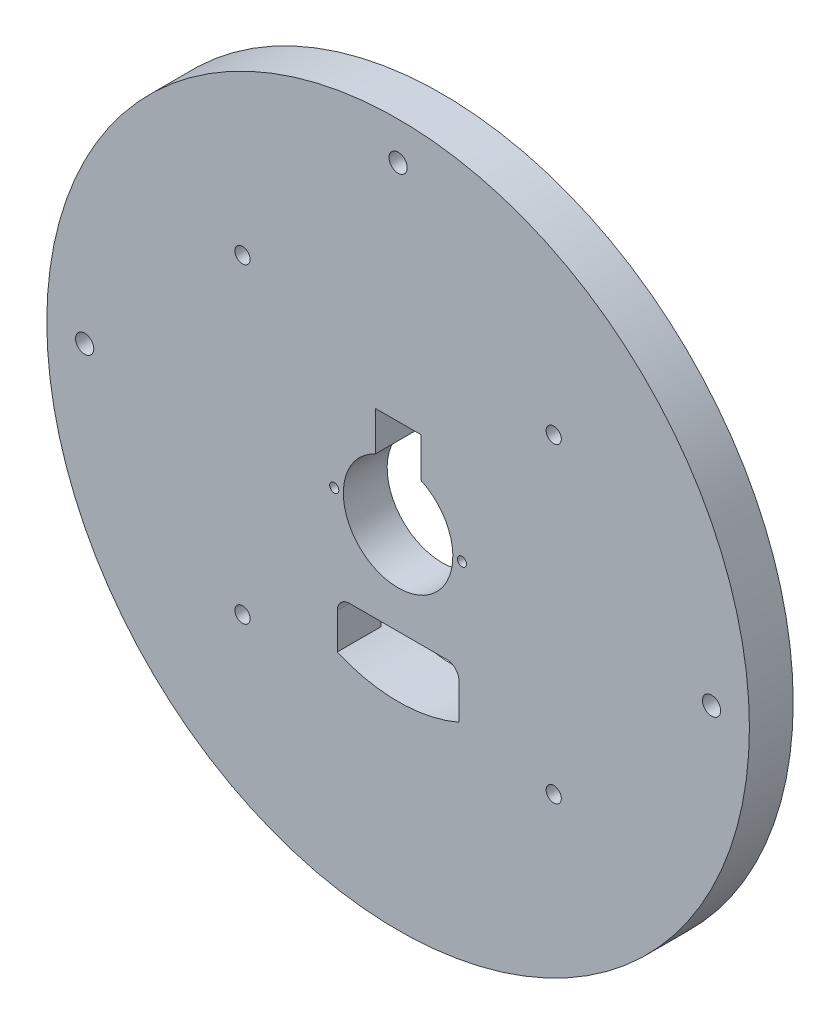
ISO-10303-21;
HEADER;
FILE_DESCRIPTION(('STEP AP214'),'2;1');
FILE_NAME('part.step','',(''),(''),'','','');
FILE_SCHEMA(('AUTOMOTIVE_DESIGN { 1 0 10303 214 1 1 1 1 }'));
ENDSEC;
DATA;
#1=APPLICATION_CONTEXT('core data for automotive mechanical design processes');
#2=APPLICATION_PROTOCOL_DEFINITION('international standard','automotive_design',2000,#1);
#3=PRODUCT_CONTEXT('',#1,'mechanical');
#4=PRODUCT('Part','Part','',(#3));
#5=PRODUCT_RELATED_PRODUCT_CATEGORY('part','',(#4));
#6=PRODUCT_DEFINITION_FORMATION('','',#4);
#7=PRODUCT_DEFINITION_CONTEXT('part definition',#1,'design');
#8=PRODUCT_DEFINITION('design','',#6,#7);
#9=PRODUCT_DEFINITION_SHAPE('','',#8);
#10=(LENGTH_UNIT() NAMED_UNIT(*) SI_UNIT(.MILLI.,.METRE.));
#11=(NAMED_UNIT(*) PLANE_ANGLE_UNIT() SI_UNIT($,.RADIAN.));
#12=(NAMED_UNIT(*) SI_UNIT($,.STERADIAN.) SOLID_ANGLE_UNIT());
#13=UNCERTAINTY_MEASURE_WITH_UNIT(LENGTH_MEASURE(1.E-05),#10,'distance_accuracy_value','');
#14=(GEOMETRIC_REPRESENTATION_CONTEXT(3) GLOBAL_UNCERTAINTY_ASSIGNED_CONTEXT((#13)) GLOBAL_UNIT_ASSIGNED_CONTEXT((#10,
#11,#12)) REPRESENTATION_CONTEXT('',''));
#15=CARTESIAN_POINT('',(0.,0.,0.));
#16=DIRECTION('',(0.,0.,1.));
#17=DIRECTION('',(1.,0.,0.));
#18=AXIS2_PLACEMENT_3D('',#15,#16,#17);
#19=CARTESIAN_POINT('',(0.,0.,0.));
#20=DIRECTION('',(0.,0.,1.));
#21=DIRECTION('',(1.,0.,0.));
#22=AXIS2_PLACEMENT_3D('',#19,#20,#21);
#23=PLANE('',#22);
#24=CARTESIAN_POINT('',(21.,0.,0.));
#25=DIRECTION('',(0.,0.,-1.));
#26=DIRECTION('',(-1.,0.,0.));
#27=AXIS2_PLACEMENT_3D('',#24,#25,#26);
#28=CIRCLE('',#27,1.49999999999999);
#29=CARTESIAN_POINT('',(19.5,0.,0.));
#30=VERTEX_POINT('',#29);
#31=EDGE_CURVE('E358',#30,#30,#28,.T.);
#32=ORIENTED_EDGE('',*,*,#31,.F.);
#33=EDGE_LOOP('',(#32));
#34=FACE_BOUND('',#33,.T.);
#35=CARTESIAN_POINT('',(-21.,0.,0.));
#36=DIRECTION('',(0.,0.,-1.));
#37=DIRECTION('',(-1.,0.,0.));
#38=AXIS2_PLACEMENT_3D('',#35,#36,#37);
#39=CIRCLE('',#38,1.49999999999999);
#40=CARTESIAN_POINT('',(-22.5,0.,0.));
#41=VERTEX_POINT('',#40);
#42=EDGE_CURVE('E364',#41,#41,#39,.T.);
#43=ORIENTED_EDGE('',*,*,#42,.F.);
#44=EDGE_LOOP('',(#43));
#45=FACE_BOUND('',#44,.T.);
#46=CARTESIAN_POINT('',(0.,0.,0.));
#47=DIRECTION('',(0.,0.,-1.));
#48=DIRECTION('',(-1.,0.,0.));
#49=AXIS2_PLACEMENT_3D('',#46,#47,#48);
#50=CIRCLE('',#49,18.);
#51=CARTESIAN_POINT('',(7.5,16.3630681719536,0.));
#52=VERTEX_POINT('',#51);
#53=CARTESIAN_POINT('',(-7.5,16.3630681719536,0.));
#54=VERTEX_POINT('',#53);
#55=EDGE_CURVE('E212',#52,#54,#50,.T.);
#56=ORIENTED_EDGE('',*,*,#55,.F.);
#57=DIRECTION('',(0.,-1.,0.));
#58=VECTOR('',#57,1.);
#59=CARTESIAN_POINT('',(7.5,16.3630681719536,0.));
#60=LINE('',#59,#58);
#61=CARTESIAN_POINT('',(7.5,29.3630681719536,0.));
#62=VERTEX_POINT('',#61);
#63=EDGE_CURVE('E227',#62,#52,#60,.T.);
#64=ORIENTED_EDGE('',*,*,#63,.F.);
#65=DIRECTION('',(1.,0.,0.));
#66=VECTOR('',#65,1.);
#67=CARTESIAN_POINT('',(7.5,29.3630681719536,0.));
#68=LINE('',#67,#66);
#69=CARTESIAN_POINT('',(-7.5,29.3630681719536,0.));
#70=VERTEX_POINT('',#69);
#71=EDGE_CURVE('E225',#70,#62,#68,.T.);
#72=ORIENTED_EDGE('',*,*,#71,.F.);
#73=DIRECTION('',(0.,1.,0.));
#74=VECTOR('',#73,1.);
#75=CARTESIAN_POINT('',(-7.5,29.3630681719536,0.));
#76=LINE('',#75,#74);
#77=EDGE_CURVE('E222',#54,#70,#76,.T.);
#78=ORIENTED_EDGE('',*,*,#77,.F.);
#79=EDGE_LOOP('',(#56,#64,#72,#78));
#80=FACE_BOUND('',#79,.T.);
#81=DIRECTION('',(0.,1.,0.));
#82=VECTOR('',#81,1.);
#83=CARTESIAN_POINT('',(20.,-46.2618633433631,0.));
#84=LINE('',#83,#82);
#85=CARTESIAN_POINT('',(20.,-46.2618633433631,0.));
#86=VERTEX_POINT('',#85);
#87=CARTESIAN_POINT('',(20.,-34.4,0.));
#88=VERTEX_POINT('',#87);
#89=EDGE_CURVE('E64',#86,#88,#84,.T.);
#90=ORIENTED_EDGE('',*,*,#89,.T.);
#91=CARTESIAN_POINT('',(16.,-34.4,0.));
#92=DIRECTION('',(0.,0.,1.));
#93=DIRECTION('',(1.,0.,0.));
#94=AXIS2_PLACEMENT_3D('',#91,#92,#93);
#95=CIRCLE('',#94,4.);
#96=CARTESIAN_POINT('',(16.,-30.4,0.));
#97=VERTEX_POINT('',#96);
#98=EDGE_CURVE('E187',#88,#97,#95,.T.);
#99=ORIENTED_EDGE('',*,*,#98,.T.);
#100=DIRECTION('',(-1.,0.,0.));
#101=VECTOR('',#100,1.);
#102=CARTESIAN_POINT('',(16.,-30.4,0.));
#103=LINE('',#102,#101);
#104=CARTESIAN_POINT('',(-16.,-30.4,0.));
#105=VERTEX_POINT('',#104);
#106=EDGE_CURVE('E205',#97,#105,#103,.T.);
#107=ORIENTED_EDGE('',*,*,#106,.T.);
#108=CARTESIAN_POINT('',(-16.,-34.4,0.));
#109=DIRECTION('',(0.,0.,1.));
#110=DIRECTION('',(1.,0.,0.));
#111=AXIS2_PLACEMENT_3D('',#108,#109,#110);
#112=CIRCLE('',#111,4.);
#113=CARTESIAN_POINT('',(-20.,-34.4,0.));
#114=VERTEX_POINT('',#113);
#115=EDGE_CURVE('E201',#105,#114,#112,.T.);
#116=ORIENTED_EDGE('',*,*,#115,.T.);
#117=DIRECTION('',(0.,-1.,0.));
#118=VECTOR('',#117,1.);
#119=CARTESIAN_POINT('',(-20.,-34.4,0.));
#120=LINE('',#119,#118);
#121=CARTESIAN_POINT('',(-20.,-46.2618633433631,0.));
#122=VERTEX_POINT('',#121);
#123=EDGE_CURVE('E199',#114,#122,#120,.T.);
#124=ORIENTED_EDGE('',*,*,#123,.T.);
#125=CARTESIAN_POINT('',(0.,0.,0.));
#126=DIRECTION('',(0.,0.,-1.));
#127=DIRECTION('',(-1.,0.,0.));
#128=AXIS2_PLACEMENT_3D('',#125,#126,#127);
#129=CIRCLE('',#128,50.4);
#130=EDGE_CURVE('E180',#122,#86,#129,.T.);
#131=ORIENTED_EDGE('',*,*,#130,.T.);
#132=EDGE_LOOP('',(#90,#99,#107,#116,#124,#131));
#133=FACE_BOUND('',#132,.T.);
#134=ADVANCED_FACE('F39',(#34,#45,#80,#133),#23,.F.);
#135=CARTESIAN_POINT('',(0.,0.,14.4));
#136=DIRECTION('',(0.,0.,-1.));
#137=DIRECTION('',(-1.,0.,0.));
#138=AXIS2_PLACEMENT_3D('',#135,#136,#137);
#139=CYLINDRICAL_SURFACE('',#138,115.5);
#140=CARTESIAN_POINT('',(0.,0.,0.));
#141=DIRECTION('',(0.,0.,1.));
#142=DIRECTION('',(1.,0.,0.));
#143=AXIS2_PLACEMENT_3D('',#140,#141,#142);
#144=CIRCLE('',#143,115.5);
#145=CARTESIAN_POINT('',(115.5,0.,0.));
#146=VERTEX_POINT('',#145);
#147=EDGE_CURVE('E303',#146,#146,#144,.T.);
#148=ORIENTED_EDGE('',*,*,#147,.T.);
#149=EDGE_LOOP('',(#148));
#150=FACE_BOUND('',#149,.T.);
#151=CARTESIAN_POINT('',(0.,0.,14.4));
#152=DIRECTION('',(0.,0.,1.));
#153=DIRECTION('',(1.,0.,0.));
#154=AXIS2_PLACEMENT_3D('',#151,#152,#153);
#155=CIRCLE('',#154,115.5);
#156=CARTESIAN_POINT('',(115.5,0.,14.4));
#157=VERTEX_POINT('',#156);
#158=EDGE_CURVE('E311',#157,#157,#155,.T.);
#159=ORIENTED_EDGE('',*,*,#158,.F.);
#160=EDGE_LOOP('',(#159));
#161=FACE_BOUND('',#160,.T.);
#162=ADVANCED_FACE('F41',(#150,#161),#139,.T.);
#163=CARTESIAN_POINT('',(0.,0.,14.4));
#164=DIRECTION('',(0.,0.,1.));
#165=DIRECTION('',(1.,0.,0.));
#166=AXIS2_PLACEMENT_3D('',#163,#164,#165);
#167=PLANE('',#166);
#168=CARTESIAN_POINT('',(-103.05,0.,14.4));
#169=DIRECTION('',(0.,0.,1.));
#170=DIRECTION('',(1.,0.,0.));
#171=AXIS2_PLACEMENT_3D('',#168,#169,#170);
#172=CIRCLE('',#171,3.);
#173=CARTESIAN_POINT('',(-100.05,0.,14.4));
#174=VERTEX_POINT('',#173);
#175=EDGE_CURVE('E43',#174,#174,#172,.T.);
#176=ORIENTED_EDGE('',*,*,#175,.F.);
#177=EDGE_LOOP('',(#176));
#178=FACE_BOUND('',#177,.T.);
#179=CARTESIAN_POINT('',(103.05,0.,14.4));
#180=DIRECTION('',(0.,0.,1.));
#181=DIRECTION('',(1.,0.,0.));
#182=AXIS2_PLACEMENT_3D('',#179,#180,#181);
#183=CIRCLE('',#182,3.);
#184=CARTESIAN_POINT('',(106.05,0.,14.4));
#185=VERTEX_POINT('',#184);
#186=EDGE_CURVE('E343',#185,#185,#183,.T.);
#187=ORIENTED_EDGE('',*,*,#186,.F.);
#188=EDGE_LOOP('',(#187));
#189=FACE_BOUND('',#188,.T.);
#190=CARTESIAN_POINT('',(0.,103.05,14.4));
#191=DIRECTION('',(0.,0.,1.));
#192=DIRECTION('',(1.,0.,0.));
#193=AXIS2_PLACEMENT_3D('',#190,#191,#192);
#194=CIRCLE('',#193,2.99999999999999);
#195=CARTESIAN_POINT('',(2.99999999999999,103.05,14.4));
#196=VERTEX_POINT('',#195);
#197=EDGE_CURVE('E339',#196,#196,#194,.T.);
#198=ORIENTED_EDGE('',*,*,#197,.F.);
#199=EDGE_LOOP('',(#198));
#200=FACE_BOUND('',#199,.T.);
#201=CARTESIAN_POINT('',(21.,0.,14.4));
#202=DIRECTION('',(0.,0.,-1.));
#203=DIRECTION('',(-1.,0.,0.));
#204=AXIS2_PLACEMENT_3D('',#201,#202,#203);
#205=CIRCLE('',#204,1.49999999999998);
#206=CARTESIAN_POINT('',(19.5,0.,14.4));
#207=VERTEX_POINT('',#206);
#208=EDGE_CURVE('E361',#207,#207,#205,.T.);
#209=ORIENTED_EDGE('',*,*,#208,.T.);
#210=EDGE_LOOP('',(#209));
#211=FACE_BOUND('',#210,.T.);
#212=CARTESIAN_POINT('',(-21.,0.,14.4));
#213=DIRECTION('',(0.,0.,-1.));
#214=DIRECTION('',(-1.,0.,0.));
#215=AXIS2_PLACEMENT_3D('',#212,#213,#214);
#216=CIRCLE('',#215,1.49999999999998);
#217=CARTESIAN_POINT('',(-22.5,0.,14.4));
#218=VERTEX_POINT('',#217);
#219=EDGE_CURVE('E367',#218,#218,#216,.T.);
#220=ORIENTED_EDGE('',*,*,#219,.T.);
#221=EDGE_LOOP('',(#220));
#222=FACE_BOUND('',#221,.T.);
#223=CARTESIAN_POINT('',(51.1597787534145,-51.1597787534147,14.4));
#224=DIRECTION('',(0.,0.,-1.));
#225=DIRECTION('',(-1.,0.,0.));
#226=AXIS2_PLACEMENT_3D('',#223,#224,#225);
#227=CIRCLE('',#226,2.5);
#228=CARTESIAN_POINT('',(48.6597787534145,-51.1597787534147,14.4));
#229=VERTEX_POINT('',#228);
#230=EDGE_CURVE('E338',#229,#229,#227,.T.);
#231=ORIENTED_EDGE('',*,*,#230,.T.);
#232=EDGE_LOOP('',(#231));
#233=FACE_BOUND('',#232,.T.);
#234=CARTESIAN_POINT('',(-51.1597787534147,-51.1597787534145,14.4));
#235=DIRECTION('',(0.,0.,-1.));
#236=DIRECTION('',(-1.,0.,0.));
#237=AXIS2_PLACEMENT_3D('',#234,#235,#236);
#238=CIRCLE('',#237,2.5);
#239=CARTESIAN_POINT('',(-53.6597787534147,-51.1597787534145,14.4));
#240=VERTEX_POINT('',#239);
#241=EDGE_CURVE('E334',#240,#240,#238,.T.);
#242=ORIENTED_EDGE('',*,*,#241,.T.);
#243=EDGE_LOOP('',(#242));
#244=FACE_BOUND('',#243,.T.);
#245=CARTESIAN_POINT('',(-51.1597787534145,51.1597787534147,14.4));
#246=DIRECTION('',(0.,0.,-1.));
#247=DIRECTION('',(-1.,0.,0.));
#248=AXIS2_PLACEMENT_3D('',#245,#246,#247);
#249=CIRCLE('',#248,2.5);
#250=CARTESIAN_POINT('',(-53.6597787534145,51.1597787534147,14.4));
#251=VERTEX_POINT('',#250);
#252=EDGE_CURVE('E330',#251,#251,#249,.T.);
#253=ORIENTED_EDGE('',*,*,#252,.T.);
#254=EDGE_LOOP('',(#253));
#255=FACE_BOUND('',#254,.T.);
#256=CARTESIAN_POINT('',(51.1597787534147,51.1597787534145,14.4));
#257=DIRECTION('',(0.,0.,-1.));
#258=DIRECTION('',(-1.,0.,0.));
#259=AXIS2_PLACEMENT_3D('',#256,#257,#258);
#260=CIRCLE('',#259,2.5);
#261=CARTESIAN_POINT('',(48.6597787534147,51.1597787534145,14.4));
#262=VERTEX_POINT('',#261);
#263=EDGE_CURVE('E190',#262,#262,#260,.T.);
#264=ORIENTED_EDGE('',*,*,#263,.T.);
#265=EDGE_LOOP('',(#264));
#266=FACE_BOUND('',#265,.T.);
#267=CARTESIAN_POINT('',(0.,0.,14.4));
#268=DIRECTION('',(0.,0.,-1.));
#269=DIRECTION('',(-1.,0.,0.));
#270=AXIS2_PLACEMENT_3D('',#267,#268,#269);
#271=CIRCLE('',#270,50.4);
#272=CARTESIAN_POINT('',(20.,-46.2618633433631,14.4));
#273=VERTEX_POINT('',#272);
#274=CARTESIAN_POINT('',(-20.,-46.2618633433631,14.4));
#275=VERTEX_POINT('',#274);
#276=EDGE_CURVE('E172',#273,#275,#271,.T.);
#277=ORIENTED_EDGE('',*,*,#276,.T.);
#278=DIRECTION('',(0.,-1.,0.));
#279=VECTOR('',#278,1.);
#280=CARTESIAN_POINT('',(-20.,-34.4,14.4));
#281=LINE('',#280,#279);
#282=CARTESIAN_POINT('',(-20.,-34.4,14.4));
#283=VERTEX_POINT('',#282);
#284=EDGE_CURVE('E163',#283,#275,#281,.T.);
#285=ORIENTED_EDGE('',*,*,#284,.F.);
#286=CARTESIAN_POINT('',(-16.,-34.4,14.4));
#287=DIRECTION('',(0.,0.,1.));
#288=DIRECTION('',(1.,0.,0.));
#289=AXIS2_PLACEMENT_3D('',#286,#287,#288);
#290=CIRCLE('',#289,4.);
#291=CARTESIAN_POINT('',(-16.,-30.4,14.4));
#292=VERTEX_POINT('',#291);
#293=EDGE_CURVE('E171',#292,#283,#290,.T.);
#294=ORIENTED_EDGE('',*,*,#293,.F.);
#295=DIRECTION('',(-1.,0.,0.));
#296=VECTOR('',#295,1.);
#297=CARTESIAN_POINT('',(16.,-30.4,14.4));
#298=LINE('',#297,#296);
#299=CARTESIAN_POINT('',(16.,-30.4,14.4));
#300=VERTEX_POINT('',#299);
#301=EDGE_CURVE('E194',#300,#292,#298,.T.);
#302=ORIENTED_EDGE('',*,*,#301,.F.);
#303=CARTESIAN_POINT('',(16.,-34.4,14.4));
#304=DIRECTION('',(0.,0.,1.));
#305=DIRECTION('',(1.,0.,0.));
#306=AXIS2_PLACEMENT_3D('',#303,#304,#305);
#307=CIRCLE('',#306,4.);
#308=CARTESIAN_POINT('',(20.,-34.4,14.4));
#309=VERTEX_POINT('',#308);
#310=EDGE_CURVE('E196',#309,#300,#307,.T.);
#311=ORIENTED_EDGE('',*,*,#310,.F.);
#312=DIRECTION('',(0.,1.,0.));
#313=VECTOR('',#312,1.);
#314=CARTESIAN_POINT('',(20.,-46.2618633433631,14.4));
#315=LINE('',#314,#313);
#316=EDGE_CURVE('E181',#273,#309,#315,.T.);
#317=ORIENTED_EDGE('',*,*,#316,.F.);
#318=EDGE_LOOP('',(#277,#285,#294,#302,#311,#317));
#319=FACE_BOUND('',#318,.T.);
#320=CARTESIAN_POINT('',(0.,0.,14.4));
#321=DIRECTION('',(0.,0.,1.));
#322=DIRECTION('',(1.,0.,0.));
#323=AXIS2_PLACEMENT_3D('',#320,#321,#322);
#324=CIRCLE('',#323,18.);
#325=CARTESIAN_POINT('',(-7.5,16.3630681719536,14.4));
#326=VERTEX_POINT('',#325);
#327=CARTESIAN_POINT('',(7.5,16.3630681719536,14.4));
#328=VERTEX_POINT('',#327);
#329=EDGE_CURVE('E11',#326,#328,#324,.T.);
#330=ORIENTED_EDGE('',*,*,#329,.F.);
#331=DIRECTION('',(0.,-1.,0.));
#332=VECTOR('',#331,1.);
#333=CARTESIAN_POINT('',(-7.5,0.,14.4));
#334=LINE('',#333,#332);
#335=CARTESIAN_POINT('',(-7.5,29.3630681719536,14.4));
#336=VERTEX_POINT('',#335);
#337=EDGE_CURVE('E319',#336,#326,#334,.T.);
#338=ORIENTED_EDGE('',*,*,#337,.F.);
#339=DIRECTION('',(-1.,0.,0.));
#340=VECTOR('',#339,1.);
#341=CARTESIAN_POINT('',(0.,29.3630681719536,14.4));
#342=LINE('',#341,#340);
#343=CARTESIAN_POINT('',(7.5,29.3630681719536,14.4));
#344=VERTEX_POINT('',#343);
#345=EDGE_CURVE('E321',#344,#336,#342,.T.);
#346=ORIENTED_EDGE('',*,*,#345,.F.);
#347=DIRECTION('',(0.,1.,0.));
#348=VECTOR('',#347,1.);
#349=CARTESIAN_POINT('',(7.5,0.,14.4));
#350=LINE('',#349,#348);
#351=EDGE_CURVE('E48',#328,#344,#350,.T.);
#352=ORIENTED_EDGE('',*,*,#351,.F.);
#353=EDGE_LOOP('',(#330,#338,#346,#352));
#354=FACE_BOUND('',#353,.T.);
#355=ORIENTED_EDGE('',*,*,#158,.T.);
#356=EDGE_LOOP('',(#355));
#357=FACE_BOUND('',#356,.T.);
#358=ADVANCED_FACE('F183',(#178,#189,#200,#211,#222,#233,#244,#255,#266,#319,#354,#357),#167,.T.);
#359=CARTESIAN_POINT('',(-103.05,0.,0.));
#360=DIRECTION('',(0.,0.,1.));
#361=DIRECTION('',(1.,0.,0.));
#362=AXIS2_PLACEMENT_3D('',#359,#360,#361);
#363=CIRCLE('',#362,3.);
#364=CARTESIAN_POINT('',(-100.05,0.,0.));
#365=VERTEX_POINT('',#364);
#366=EDGE_CURVE('E345',#365,#365,#363,.T.);
#367=ORIENTED_EDGE('',*,*,#366,.T.);
#368=EDGE_LOOP('',(#367));
#369=FACE_BOUND('',#368,.T.);
#370=CARTESIAN_POINT('',(103.05,0.,0.));
#371=DIRECTION('',(0.,0.,1.));
#372=DIRECTION('',(1.,0.,0.));
#373=AXIS2_PLACEMENT_3D('',#370,#371,#372);
#374=CIRCLE('',#373,3.);
#375=CARTESIAN_POINT('',(106.05,0.,0.));
#376=VERTEX_POINT('',#375);
#377=EDGE_CURVE('E342',#376,#376,#374,.T.);
#378=ORIENTED_EDGE('',*,*,#377,.T.);
#379=EDGE_LOOP('',(#378));
#380=FACE_BOUND('',#379,.T.);
#381=CARTESIAN_POINT('',(0.,103.05,0.));
#382=DIRECTION('',(0.,0.,1.));
#383=DIRECTION('',(1.,0.,0.));
#384=AXIS2_PLACEMENT_3D('',#381,#382,#383);
#385=CIRCLE('',#384,2.99999999999999);
#386=CARTESIAN_POINT('',(2.99999999999999,103.05,0.));
#387=VERTEX_POINT('',#386);
#388=EDGE_CURVE('E341',#387,#387,#385,.T.);
#389=ORIENTED_EDGE('',*,*,#388,.T.);
#390=EDGE_LOOP('',(#389));
#391=FACE_BOUND('',#390,.T.);
#392=CARTESIAN_POINT('',(0.,0.,0.));
#393=DIRECTION('',(0.,0.,1.));
#394=DIRECTION('',(1.,0.,0.));
#395=AXIS2_PLACEMENT_3D('',#392,#393,#394);
#396=CIRCLE('',#395,90.6);
#397=CARTESIAN_POINT('',(90.6,0.,0.));
#398=VERTEX_POINT('',#397);
#399=EDGE_CURVE('E314',#398,#398,#396,.F.);
#400=ORIENTED_EDGE('',*,*,#399,.F.);
#401=EDGE_LOOP('',(#400));
#402=FACE_BOUND('',#401,.T.);
#403=ORIENTED_EDGE('',*,*,#147,.F.);
#404=EDGE_LOOP('',(#403));
#405=FACE_BOUND('',#404,.T.);
#406=ADVANCED_FACE('F391',(#369,#380,#391,#402,#405),#23,.F.);
#407=CARTESIAN_POINT('',(0.,0.,-5.));
#408=DIRECTION('',(0.,0.,1.));
#409=DIRECTION('',(1.,0.,0.));
#410=AXIS2_PLACEMENT_3D('',#407,#408,#409);
#411=CYLINDRICAL_SURFACE('',#410,85.6);
#412=CARTESIAN_POINT('',(0.,0.,0.));
#413=DIRECTION('',(0.,0.,-1.));
#414=DIRECTION('',(-1.,0.,0.));
#415=AXIS2_PLACEMENT_3D('',#412,#413,#414);
#416=CIRCLE('',#415,85.6);
#417=CARTESIAN_POINT('',(85.4479373653922,-5.10000000000001,0.));
#418=VERTEX_POINT('',#417);
#419=CARTESIAN_POINT('',(-85.4479373653922,-5.10000000000001,0.));
#420=VERTEX_POINT('',#419);
#421=EDGE_CURVE('E279',#418,#420,#416,.T.);
#422=ORIENTED_EDGE('',*,*,#421,.F.);
#423=DIRECTION('',(0.,0.,1.));
#424=VECTOR('',#423,1.);
#425=CARTESIAN_POINT('',(85.4479373653922,-5.10000000000001,-5.));
#426=LINE('',#425,#424);
#427=CARTESIAN_POINT('',(85.4479373653922,-5.10000000000001,-5.));
#428=VERTEX_POINT('',#427);
#429=EDGE_CURVE('E300',#428,#418,#426,.T.);
#430=ORIENTED_EDGE('',*,*,#429,.F.);
#431=CARTESIAN_POINT('',(0.,0.,-5.));
#432=DIRECTION('',(0.,0.,-1.));
#433=DIRECTION('',(-1.,0.,0.));
#434=AXIS2_PLACEMENT_3D('',#431,#432,#433);
#435=CIRCLE('',#434,85.6);
#436=CARTESIAN_POINT('',(-85.4479373653922,-5.10000000000001,-5.));
#437=VERTEX_POINT('',#436);
#438=EDGE_CURVE('E251',#428,#437,#435,.T.);
#439=ORIENTED_EDGE('',*,*,#438,.T.);
#440=DIRECTION('',(0.,0.,1.));
#441=VECTOR('',#440,1.);
#442=CARTESIAN_POINT('',(-85.4479373653922,-5.10000000000001,-5.));
#443=LINE('',#442,#441);
#444=EDGE_CURVE('E290',#437,#420,#443,.T.);
#445=ORIENTED_EDGE('',*,*,#444,.T.);
#446=EDGE_LOOP('',(#422,#430,#439,#445));
#447=FACE_BOUND('',#446,.T.);
#448=ADVANCED_FACE('F430',(#447),#411,.F.);
#449=CARTESIAN_POINT('',(-5.16213328745754E-13,-5.09999999999136,-5.));
#450=DIRECTION('',(-1.01218299754241E-13,-1.,0.));
#451=DIRECTION('',(1.,-1.01218299754241E-13,0.));
#452=AXIS2_PLACEMENT_3D('',#449,#450,#451);
#453=PLANE('',#452);
#454=DIRECTION('',(1.,-1.01218299754241E-13,0.));
#455=VECTOR('',#454,1.);
#456=CARTESIAN_POINT('',(-5.16213328745754E-13,-5.09999999999136,0.));
#457=LINE('',#456,#455);
#458=CARTESIAN_POINT('',(55.1647532397272,-5.1,0.));
#459=VERTEX_POINT('',#458);
#460=EDGE_CURVE('E281',#459,#418,#457,.T.);
#461=ORIENTED_EDGE('',*,*,#460,.F.);
#462=DIRECTION('',(0.,0.,1.));
#463=VECTOR('',#462,1.);
#464=CARTESIAN_POINT('',(55.1647532397272,-5.1,-5.));
#465=LINE('',#464,#463);
#466=CARTESIAN_POINT('',(55.1647532397272,-5.1,-5.));
#467=VERTEX_POINT('',#466);
#468=EDGE_CURVE('E297',#467,#459,#465,.T.);
#469=ORIENTED_EDGE('',*,*,#468,.F.);
#470=DIRECTION('',(1.,-1.01218299754241E-13,0.));
#471=VECTOR('',#470,1.);
#472=CARTESIAN_POINT('',(-5.16213328745754E-13,-5.09999999999136,-5.));
#473=LINE('',#472,#471);
#474=EDGE_CURVE('E254',#467,#428,#473,.T.);
#475=ORIENTED_EDGE('',*,*,#474,.T.);
#476=ORIENTED_EDGE('',*,*,#429,.T.);
#477=EDGE_LOOP('',(#461,#469,#475,#476));
#478=FACE_BOUND('',#477,.T.);
#479=ADVANCED_FACE('F467',(#478),#453,.T.);
#480=CARTESIAN_POINT('',(0.,0.,-5.));
#481=DIRECTION('',(0.,0.,1.));
#482=DIRECTION('',(1.,0.,0.));
#483=AXIS2_PLACEMENT_3D('',#480,#481,#482);
#484=CYLINDRICAL_SURFACE('',#483,55.4);
#485=CARTESIAN_POINT('',(0.,0.,0.));
#486=DIRECTION('',(0.,0.,-1.));
#487=DIRECTION('',(-1.,0.,0.));
#488=AXIS2_PLACEMENT_3D('',#485,#486,#487);
#489=CIRCLE('',#488,55.4);
#490=CARTESIAN_POINT('',(-55.1647532397272,-5.1,0.));
#491=VERTEX_POINT('',#490);
#492=EDGE_CURVE('E283',#459,#491,#489,.T.);
#493=ORIENTED_EDGE('',*,*,#492,.T.);
#494=DIRECTION('',(0.,0.,1.));
#495=VECTOR('',#494,1.);
#496=CARTESIAN_POINT('',(-55.1647532397272,-5.1,-5.));
#497=LINE('',#496,#495);
#498=CARTESIAN_POINT('',(-55.1647532397272,-5.1,-5.));
#499=VERTEX_POINT('',#498);
#500=EDGE_CURVE('E293',#499,#491,#497,.T.);
#501=ORIENTED_EDGE('',*,*,#500,.F.);
#502=CARTESIAN_POINT('',(0.,0.,-5.));
#503=DIRECTION('',(0.,0.,-1.));
#504=DIRECTION('',(-1.,0.,0.));
#505=AXIS2_PLACEMENT_3D('',#502,#503,#504);
#506=CIRCLE('',#505,55.4);
#507=EDGE_CURVE('E257',#467,#499,#506,.T.);
#508=ORIENTED_EDGE('',*,*,#507,.F.);
#509=ORIENTED_EDGE('',*,*,#468,.T.);
#510=EDGE_LOOP('',(#493,#501,#508,#509));
#511=FACE_BOUND('',#510,.T.);
#512=ADVANCED_FACE('F475',(#511),#484,.T.);
#513=CARTESIAN_POINT('',(0.,0.,-5.));
#514=DIRECTION('',(0.,0.,1.));
#515=DIRECTION('',(1.,0.,0.));
#516=AXIS2_PLACEMENT_3D('',#513,#514,#515);
#517=CYLINDRICAL_SURFACE('',#516,85.6);
#518=CARTESIAN_POINT('',(0.,0.,0.));
#519=DIRECTION('',(0.,0.,-1.));
#520=DIRECTION('',(-1.,0.,0.));
#521=AXIS2_PLACEMENT_3D('',#518,#519,#520);
#522=CIRCLE('',#521,85.6);
#523=CARTESIAN_POINT('',(-85.4479373653922,5.09999999999999,0.));
#524=VERTEX_POINT('',#523);
#525=CARTESIAN_POINT('',(85.4479373653922,5.09999999999999,0.));
#526=VERTEX_POINT('',#525);
#527=EDGE_CURVE('E233',#524,#526,#522,.T.);
#528=ORIENTED_EDGE('',*,*,#527,.F.);
#529=DIRECTION('',(0.,0.,1.));
#530=VECTOR('',#529,1.);
#531=CARTESIAN_POINT('',(-85.4479373653922,5.09999999999999,-5.));
#532=LINE('',#531,#530);
#533=CARTESIAN_POINT('',(-85.4479373653922,5.09999999999999,-5.));
#534=VERTEX_POINT('',#533);
#535=EDGE_CURVE('E294',#534,#524,#532,.T.);
#536=ORIENTED_EDGE('',*,*,#535,.F.);
#537=CARTESIAN_POINT('',(0.,0.,-5.));
#538=DIRECTION('',(0.,0.,-1.));
#539=DIRECTION('',(-1.,0.,0.));
#540=AXIS2_PLACEMENT_3D('',#537,#538,#539);
#541=CIRCLE('',#540,85.6);
#542=CARTESIAN_POINT('',(85.4479373653922,5.09999999999999,-5.));
#543=VERTEX_POINT('',#542);
#544=EDGE_CURVE('E240',#534,#543,#541,.T.);
#545=ORIENTED_EDGE('',*,*,#544,.T.);
#546=DIRECTION('',(0.,0.,1.));
#547=VECTOR('',#546,1.);
#548=CARTESIAN_POINT('',(85.4479373653922,5.09999999999999,-5.));
#549=LINE('',#548,#547);
#550=EDGE_CURVE('E268',#543,#526,#549,.T.);
#551=ORIENTED_EDGE('',*,*,#550,.T.);
#552=EDGE_LOOP('',(#528,#536,#545,#551));
#553=FACE_BOUND('',#552,.T.);
#554=ADVANCED_FACE('F403',(#553),#517,.F.);
#555=CARTESIAN_POINT('',(-5.1621332874735E-13,5.10000000000864,-5.));
#556=DIRECTION('',(-1.01218299754211E-13,1.,0.));
#557=DIRECTION('',(-1.,-1.01218299754211E-13,0.));
#558=AXIS2_PLACEMENT_3D('',#555,#556,#557);
#559=PLANE('',#558);
#560=DIRECTION('',(-1.,-1.01218299754211E-13,0.));
#561=VECTOR('',#560,1.);
#562=CARTESIAN_POINT('',(-5.1621332874735E-13,5.10000000000864,0.));
#563=LINE('',#562,#561);
#564=CARTESIAN_POINT('',(-55.1647532397272,5.1,0.));
#565=VERTEX_POINT('',#564);
#566=EDGE_CURVE('E271',#565,#524,#563,.T.);
#567=ORIENTED_EDGE('',*,*,#566,.F.);
#568=DIRECTION('',(0.,0.,1.));
#569=VECTOR('',#568,1.);
#570=CARTESIAN_POINT('',(-55.1647532397272,5.1,-5.));
#571=LINE('',#570,#569);
#572=CARTESIAN_POINT('',(-55.1647532397272,5.1,-5.));
#573=VERTEX_POINT('',#572);
#574=EDGE_CURVE('E308',#573,#565,#571,.T.);
#575=ORIENTED_EDGE('',*,*,#574,.F.);
#576=DIRECTION('',(-1.,-1.01218299754211E-13,0.));
#577=VECTOR('',#576,1.);
#578=CARTESIAN_POINT('',(-5.1621332874735E-13,5.10000000000864,-5.));
#579=LINE('',#578,#577);
#580=EDGE_CURVE('E243',#573,#534,#579,.T.);
#581=ORIENTED_EDGE('',*,*,#580,.T.);
#582=ORIENTED_EDGE('',*,*,#535,.T.);
#583=EDGE_LOOP('',(#567,#575,#581,#582));
#584=FACE_BOUND('',#583,.T.);
#585=ADVANCED_FACE('F398',(#584),#559,.T.);
#586=CARTESIAN_POINT('',(0.,0.,-5.));
#587=DIRECTION('',(0.,0.,1.));
#588=DIRECTION('',(1.,0.,0.));
#589=AXIS2_PLACEMENT_3D('',#586,#587,#588);
#590=CYLINDRICAL_SURFACE('',#589,55.4);
#591=CARTESIAN_POINT('',(0.,0.,0.));
#592=DIRECTION('',(0.,0.,-1.));
#593=DIRECTION('',(-1.,0.,0.));
#594=AXIS2_PLACEMENT_3D('',#591,#592,#593);
#595=CIRCLE('',#594,55.4);
#596=CARTESIAN_POINT('',(55.1647532397272,5.1,0.));
#597=VERTEX_POINT('',#596);
#598=EDGE_CURVE('E274',#565,#597,#595,.T.);
#599=ORIENTED_EDGE('',*,*,#598,.T.);
#600=DIRECTION('',(0.,0.,1.));
#601=VECTOR('',#600,1.);
#602=CARTESIAN_POINT('',(55.1647532397272,5.1,-5.));
#603=LINE('',#602,#601);
#604=CARTESIAN_POINT('',(55.1647532397272,5.1,-5.));
#605=VERTEX_POINT('',#604);
#606=EDGE_CURVE('E305',#605,#597,#603,.T.);
#607=ORIENTED_EDGE('',*,*,#606,.F.);
#608=CARTESIAN_POINT('',(0.,0.,-5.));
#609=DIRECTION('',(0.,0.,-1.));
#610=DIRECTION('',(-1.,0.,0.));
#611=AXIS2_PLACEMENT_3D('',#608,#609,#610);
#612=CIRCLE('',#611,55.4);
#613=EDGE_CURVE('E246',#573,#605,#612,.T.);
#614=ORIENTED_EDGE('',*,*,#613,.F.);
#615=ORIENTED_EDGE('',*,*,#574,.T.);
#616=EDGE_LOOP('',(#599,#607,#614,#615));
#617=FACE_BOUND('',#616,.T.);
#618=ADVANCED_FACE('F410',(#617),#590,.T.);
#619=CARTESIAN_POINT('',(0.,0.,-5.));
#620=DIRECTION('',(0.,0.,1.));
#621=DIRECTION('',(1.,0.,0.));
#622=AXIS2_PLACEMENT_3D('',#619,#620,#621);
#623=CYLINDRICAL_SURFACE('',#622,50.4);
#624=CARTESIAN_POINT('',(0.,0.,-5.));
#625=DIRECTION('',(0.,0.,-1.));
#626=DIRECTION('',(-1.,0.,0.));
#627=AXIS2_PLACEMENT_3D('',#624,#625,#626);
#628=CIRCLE('',#627,50.4);
#629=CARTESIAN_POINT('',(-50.4,0.,-5.));
#630=VERTEX_POINT('',#629);
#631=EDGE_CURVE('E262',#630,#630,#628,.T.);
#632=ORIENTED_EDGE('',*,*,#631,.T.);
#633=EDGE_LOOP('',(#632));
#634=FACE_BOUND('',#633,.T.);
#635=ORIENTED_EDGE('',*,*,#130,.F.);
#636=DIRECTION('',(0.,0.,-1.));
#637=VECTOR('',#636,1.);
#638=CARTESIAN_POINT('',(-20.,-46.2618633433631,14.4));
#639=LINE('',#638,#637);
#640=EDGE_CURVE('E166',#275,#122,#639,.T.);
#641=ORIENTED_EDGE('',*,*,#640,.F.);
#642=ORIENTED_EDGE('',*,*,#276,.F.);
#643=DIRECTION('',(0.,0.,-1.));
#644=VECTOR('',#643,1.);
#645=CARTESIAN_POINT('',(20.,-46.2618633433631,14.4));
#646=LINE('',#645,#644);
#647=EDGE_CURVE('E210',#273,#86,#646,.T.);
#648=ORIENTED_EDGE('',*,*,#647,.T.);
#649=EDGE_LOOP('',(#635,#641,#642,#648));
#650=FACE_BOUND('',#649,.T.);
#651=ADVANCED_FACE('F177',(#634,#650),#623,.F.);
#652=CARTESIAN_POINT('',(0.,-5.1,-5.));
#653=DIRECTION('',(0.,1.,0.));
#654=DIRECTION('',(0.,0.,1.));
#655=AXIS2_PLACEMENT_3D('',#652,#653,#654);
#656=PLANE('',#655);
#657=DIRECTION('',(-1.,0.,0.));
#658=VECTOR('',#657,1.);
#659=CARTESIAN_POINT('',(0.,-5.1,0.));
#660=LINE('',#659,#658);
#661=EDGE_CURVE('E286',#491,#420,#660,.T.);
#662=ORIENTED_EDGE('',*,*,#661,.T.);
#663=ORIENTED_EDGE('',*,*,#444,.F.);
#664=DIRECTION('',(-1.,0.,0.));
#665=VECTOR('',#664,1.);
#666=CARTESIAN_POINT('',(0.,-5.1,-5.));
#667=LINE('',#666,#665);
#668=EDGE_CURVE('E260',#499,#437,#667,.T.);
#669=ORIENTED_EDGE('',*,*,#668,.F.);
#670=ORIENTED_EDGE('',*,*,#500,.T.);
#671=EDGE_LOOP('',(#662,#663,#669,#670));
#672=FACE_BOUND('',#671,.T.);
#673=ADVANCED_FACE('F471',(#672),#656,.F.);
#674=CARTESIAN_POINT('',(0.,5.1,-5.));
#675=DIRECTION('',(0.,1.,0.));
#676=DIRECTION('',(0.,0.,1.));
#677=AXIS2_PLACEMENT_3D('',#674,#675,#676);
#678=PLANE('',#677);
#679=DIRECTION('',(-1.,0.,0.));
#680=VECTOR('',#679,1.);
#681=CARTESIAN_POINT('',(0.,5.1,0.));
#682=LINE('',#681,#680);
#683=EDGE_CURVE('E276',#526,#597,#682,.T.);
#684=ORIENTED_EDGE('',*,*,#683,.F.);
#685=ORIENTED_EDGE('',*,*,#550,.F.);
#686=DIRECTION('',(-1.,0.,0.));
#687=VECTOR('',#686,1.);
#688=CARTESIAN_POINT('',(0.,5.1,-5.));
#689=LINE('',#688,#687);
#690=EDGE_CURVE('E248',#543,#605,#689,.T.);
#691=ORIENTED_EDGE('',*,*,#690,.T.);
#692=ORIENTED_EDGE('',*,*,#606,.T.);
#693=EDGE_LOOP('',(#684,#685,#691,#692));
#694=FACE_BOUND('',#693,.T.);
#695=ADVANCED_FACE('F407',(#694),#678,.T.);
#696=CARTESIAN_POINT('',(0.,0.,-5.));
#697=DIRECTION('',(0.,0.,1.));
#698=DIRECTION('',(1.,0.,0.));
#699=AXIS2_PLACEMENT_3D('',#696,#697,#698);
#700=CYLINDRICAL_SURFACE('',#699,90.6);
#701=CARTESIAN_POINT('',(0.,0.,-5.));
#702=DIRECTION('',(0.,0.,-1.));
#703=DIRECTION('',(-1.,0.,0.));
#704=AXIS2_PLACEMENT_3D('',#701,#702,#703);
#705=CIRCLE('',#704,90.6);
#706=CARTESIAN_POINT('',(-90.6,0.,-5.));
#707=VERTEX_POINT('',#706);
#708=EDGE_CURVE('E265',#707,#707,#705,.T.);
#709=ORIENTED_EDGE('',*,*,#708,.F.);
#710=EDGE_LOOP('',(#709));
#711=FACE_BOUND('',#710,.T.);
#712=ORIENTED_EDGE('',*,*,#399,.T.);
#713=EDGE_LOOP('',(#712));
#714=FACE_BOUND('',#713,.T.);
#715=ADVANCED_FACE('F414',(#711,#714),#700,.T.);
#716=CARTESIAN_POINT('',(0.,0.,-5.));
#717=DIRECTION('',(0.,0.,-1.));
#718=DIRECTION('',(-1.,0.,0.));
#719=AXIS2_PLACEMENT_3D('',#716,#717,#718);
#720=PLANE('',#719);
#721=ORIENTED_EDGE('',*,*,#544,.F.);
#722=ORIENTED_EDGE('',*,*,#580,.F.);
#723=ORIENTED_EDGE('',*,*,#613,.T.);
#724=ORIENTED_EDGE('',*,*,#690,.F.);
#725=EDGE_LOOP('',(#721,#722,#723,#724));
#726=FACE_BOUND('',#725,.T.);
#727=ORIENTED_EDGE('',*,*,#438,.F.);
#728=ORIENTED_EDGE('',*,*,#474,.F.);
#729=ORIENTED_EDGE('',*,*,#507,.T.);
#730=ORIENTED_EDGE('',*,*,#668,.T.);
#731=EDGE_LOOP('',(#727,#728,#729,#730));
#732=FACE_BOUND('',#731,.T.);
#733=ORIENTED_EDGE('',*,*,#631,.F.);
#734=EDGE_LOOP('',(#733));
#735=FACE_BOUND('',#734,.T.);
#736=ORIENTED_EDGE('',*,*,#708,.T.);
#737=EDGE_LOOP('',(#736));
#738=FACE_BOUND('',#737,.T.);
#739=ADVANCED_FACE('F390',(#726,#732,#735,#738),#720,.T.);
#740=CARTESIAN_POINT('',(-51.1597787534145,51.1597787534147,0.));
#741=DIRECTION('',(0.,0.,1.));
#742=DIRECTION('',(1.,0.,0.));
#743=AXIS2_PLACEMENT_3D('',#740,#741,#742);
#744=CIRCLE('',#743,2.5);
#745=CARTESIAN_POINT('',(-48.6597787534145,51.1597787534147,0.));
#746=VERTEX_POINT('',#745);
#747=EDGE_CURVE('E327',#746,#746,#744,.T.);
#748=ORIENTED_EDGE('',*,*,#747,.T.);
#749=EDGE_LOOP('',(#748));
#750=FACE_BOUND('',#749,.T.);
#751=CARTESIAN_POINT('',(51.1597787534147,51.1597787534145,0.));
#752=DIRECTION('',(0.,0.,1.));
#753=DIRECTION('',(1.,0.,0.));
#754=AXIS2_PLACEMENT_3D('',#751,#752,#753);
#755=CIRCLE('',#754,2.5);
#756=CARTESIAN_POINT('',(53.6597787534147,51.1597787534145,0.));
#757=VERTEX_POINT('',#756);
#758=EDGE_CURVE('E202',#757,#757,#755,.T.);
#759=ORIENTED_EDGE('',*,*,#758,.T.);
#760=EDGE_LOOP('',(#759));
#761=FACE_BOUND('',#760,.T.);
#762=ORIENTED_EDGE('',*,*,#566,.T.);
#763=ORIENTED_EDGE('',*,*,#527,.T.);
#764=ORIENTED_EDGE('',*,*,#683,.T.);
#765=ORIENTED_EDGE('',*,*,#598,.F.);
#766=EDGE_LOOP('',(#762,#763,#764,#765));
#767=FACE_BOUND('',#766,.T.);
#768=ADVANCED_FACE('F386',(#750,#761,#767),#23,.F.);
#769=CARTESIAN_POINT('',(51.1597787534145,-51.1597787534147,0.));
#770=DIRECTION('',(0.,0.,1.));
#771=DIRECTION('',(1.,0.,0.));
#772=AXIS2_PLACEMENT_3D('',#769,#770,#771);
#773=CIRCLE('',#772,2.5);
#774=CARTESIAN_POINT('',(53.6597787534145,-51.1597787534147,0.));
#775=VERTEX_POINT('',#774);
#776=EDGE_CURVE('E335',#775,#775,#773,.T.);
#777=ORIENTED_EDGE('',*,*,#776,.T.);
#778=EDGE_LOOP('',(#777));
#779=FACE_BOUND('',#778,.T.);
#780=CARTESIAN_POINT('',(-51.1597787534147,-51.1597787534145,0.));
#781=DIRECTION('',(0.,0.,1.));
#782=DIRECTION('',(1.,0.,0.));
#783=AXIS2_PLACEMENT_3D('',#780,#781,#782);
#784=CIRCLE('',#783,2.5);
#785=CARTESIAN_POINT('',(-48.6597787534147,-51.1597787534145,0.));
#786=VERTEX_POINT('',#785);
#787=EDGE_CURVE('E331',#786,#786,#784,.T.);
#788=ORIENTED_EDGE('',*,*,#787,.T.);
#789=EDGE_LOOP('',(#788));
#790=FACE_BOUND('',#789,.T.);
#791=ORIENTED_EDGE('',*,*,#460,.T.);
#792=ORIENTED_EDGE('',*,*,#421,.T.);
#793=ORIENTED_EDGE('',*,*,#661,.F.);
#794=ORIENTED_EDGE('',*,*,#492,.F.);
#795=EDGE_LOOP('',(#791,#792,#793,#794));
#796=FACE_BOUND('',#795,.T.);
#797=ADVANCED_FACE('F389',(#779,#790,#796),#23,.F.);
#798=CARTESIAN_POINT('',(0.,0.,18.4));
#799=DIRECTION('',(0.,0.,-1.));
#800=DIRECTION('',(-1.,0.,0.));
#801=AXIS2_PLACEMENT_3D('',#798,#799,#800);
#802=CYLINDRICAL_SURFACE('',#801,18.);
#803=ORIENTED_EDGE('',*,*,#329,.T.);
#804=DIRECTION('',(0.,0.,-1.));
#805=VECTOR('',#804,1.);
#806=CARTESIAN_POINT('',(7.5,16.3630681719536,18.4));
#807=LINE('',#806,#805);
#808=EDGE_CURVE('E231',#328,#52,#807,.T.);
#809=ORIENTED_EDGE('',*,*,#808,.T.);
#810=ORIENTED_EDGE('',*,*,#55,.T.);
#811=DIRECTION('',(0.,0.,-1.));
#812=VECTOR('',#811,1.);
#813=CARTESIAN_POINT('',(-7.5,16.3630681719536,18.4));
#814=LINE('',#813,#812);
#815=EDGE_CURVE('E230',#326,#54,#814,.T.);
#816=ORIENTED_EDGE('',*,*,#815,.F.);
#817=EDGE_LOOP('',(#803,#809,#810,#816));
#818=FACE_BOUND('',#817,.T.);
#819=ADVANCED_FACE('F452',(#818),#802,.F.);
#820=CARTESIAN_POINT('',(7.5,16.3630681719536,18.4));
#821=DIRECTION('',(1.,0.,0.));
#822=DIRECTION('',(0.,0.,-1.));
#823=AXIS2_PLACEMENT_3D('',#820,#821,#822);
#824=PLANE('',#823);
#825=ORIENTED_EDGE('',*,*,#351,.T.);
#826=DIRECTION('',(0.,0.,-1.));
#827=VECTOR('',#826,1.);
#828=CARTESIAN_POINT('',(7.5,29.3630681719536,18.4));
#829=LINE('',#828,#827);
#830=EDGE_CURVE('E234',#344,#62,#829,.T.);
#831=ORIENTED_EDGE('',*,*,#830,.T.);
#832=ORIENTED_EDGE('',*,*,#63,.T.);
#833=ORIENTED_EDGE('',*,*,#808,.F.);
#834=EDGE_LOOP('',(#825,#831,#832,#833));
#835=FACE_BOUND('',#834,.T.);
#836=ADVANCED_FACE('F457',(#835),#824,.F.);
#837=CARTESIAN_POINT('',(7.5,29.3630681719536,18.4));
#838=DIRECTION('',(0.,1.,0.));
#839=DIRECTION('',(0.,0.,1.));
#840=AXIS2_PLACEMENT_3D('',#837,#838,#839);
#841=PLANE('',#840);
#842=ORIENTED_EDGE('',*,*,#345,.T.);
#843=DIRECTION('',(0.,0.,-1.));
#844=VECTOR('',#843,1.);
#845=CARTESIAN_POINT('',(-7.5,29.3630681719536,18.4));
#846=LINE('',#845,#844);
#847=EDGE_CURVE('E237',#336,#70,#846,.T.);
#848=ORIENTED_EDGE('',*,*,#847,.T.);
#849=ORIENTED_EDGE('',*,*,#71,.T.);
#850=ORIENTED_EDGE('',*,*,#830,.F.);
#851=EDGE_LOOP('',(#842,#848,#849,#850));
#852=FACE_BOUND('',#851,.T.);
#853=ADVANCED_FACE('F715',(#852),#841,.F.);
#854=CARTESIAN_POINT('',(-7.5,29.3630681719536,18.4));
#855=DIRECTION('',(-1.,0.,0.));
#856=DIRECTION('',(0.,0.,1.));
#857=AXIS2_PLACEMENT_3D('',#854,#855,#856);
#858=PLANE('',#857);
#859=ORIENTED_EDGE('',*,*,#337,.T.);
#860=ORIENTED_EDGE('',*,*,#815,.T.);
#861=ORIENTED_EDGE('',*,*,#77,.T.);
#862=ORIENTED_EDGE('',*,*,#847,.F.);
#863=EDGE_LOOP('',(#859,#860,#861,#862));
#864=FACE_BOUND('',#863,.T.);
#865=ADVANCED_FACE('F706',(#864),#858,.F.);
#866=CARTESIAN_POINT('',(20.,-46.2618633433631,14.4));
#867=DIRECTION('',(-1.,0.,0.));
#868=DIRECTION('',(0.,-1.,0.));
#869=AXIS2_PLACEMENT_3D('',#866,#867,#868);
#870=PLANE('',#869);
#871=ORIENTED_EDGE('',*,*,#89,.F.);
#872=ORIENTED_EDGE('',*,*,#647,.F.);
#873=ORIENTED_EDGE('',*,*,#316,.T.);
#874=DIRECTION('',(0.,0.,-1.));
#875=VECTOR('',#874,1.);
#876=CARTESIAN_POINT('',(20.,-34.4,14.4));
#877=LINE('',#876,#875);
#878=EDGE_CURVE('E213',#309,#88,#877,.T.);
#879=ORIENTED_EDGE('',*,*,#878,.T.);
#880=EDGE_LOOP('',(#871,#872,#873,#879));
#881=FACE_BOUND('',#880,.T.);
#882=ADVANCED_FACE('F697',(#881),#870,.T.);
#883=CARTESIAN_POINT('',(16.,-34.4,14.4));
#884=DIRECTION('',(0.,0.,-1.));
#885=DIRECTION('',(-1.,0.,0.));
#886=AXIS2_PLACEMENT_3D('',#883,#884,#885);
#887=CYLINDRICAL_SURFACE('',#886,4.);
#888=ORIENTED_EDGE('',*,*,#98,.F.);
#889=ORIENTED_EDGE('',*,*,#878,.F.);
#890=ORIENTED_EDGE('',*,*,#310,.T.);
#891=DIRECTION('',(0.,0.,-1.));
#892=VECTOR('',#891,1.);
#893=CARTESIAN_POINT('',(16.,-30.4,14.4));
#894=LINE('',#893,#892);
#895=EDGE_CURVE('E215',#300,#97,#894,.T.);
#896=ORIENTED_EDGE('',*,*,#895,.T.);
#897=EDGE_LOOP('',(#888,#889,#890,#896));
#898=FACE_BOUND('',#897,.T.);
#899=ADVANCED_FACE('F687',(#898),#887,.F.);
#900=CARTESIAN_POINT('',(16.,-30.4,14.4));
#901=DIRECTION('',(0.,-1.,0.));
#902=DIRECTION('',(0.,0.,-1.));
#903=AXIS2_PLACEMENT_3D('',#900,#901,#902);
#904=PLANE('',#903);
#905=ORIENTED_EDGE('',*,*,#106,.F.);
#906=ORIENTED_EDGE('',*,*,#895,.F.);
#907=ORIENTED_EDGE('',*,*,#301,.T.);
#908=DIRECTION('',(0.,0.,-1.));
#909=VECTOR('',#908,1.);
#910=CARTESIAN_POINT('',(-16.,-30.4,14.4));
#911=LINE('',#910,#909);
#912=EDGE_CURVE('E217',#292,#105,#911,.T.);
#913=ORIENTED_EDGE('',*,*,#912,.T.);
#914=EDGE_LOOP('',(#905,#906,#907,#913));
#915=FACE_BOUND('',#914,.T.);
#916=ADVANCED_FACE('F678',(#915),#904,.T.);
#917=CARTESIAN_POINT('',(-16.,-34.4,14.4));
#918=DIRECTION('',(0.,0.,-1.));
#919=DIRECTION('',(-1.,0.,0.));
#920=AXIS2_PLACEMENT_3D('',#917,#918,#919);
#921=CYLINDRICAL_SURFACE('',#920,4.);
#922=ORIENTED_EDGE('',*,*,#115,.F.);
#923=ORIENTED_EDGE('',*,*,#912,.F.);
#924=ORIENTED_EDGE('',*,*,#293,.T.);
#925=DIRECTION('',(0.,0.,-1.));
#926=VECTOR('',#925,1.);
#927=CARTESIAN_POINT('',(-20.,-34.4,14.4));
#928=LINE('',#927,#926);
#929=EDGE_CURVE('E56',#283,#114,#928,.T.);
#930=ORIENTED_EDGE('',*,*,#929,.T.);
#931=EDGE_LOOP('',(#922,#923,#924,#930));
#932=FACE_BOUND('',#931,.T.);
#933=ADVANCED_FACE('F670',(#932),#921,.F.);
#934=CARTESIAN_POINT('',(-20.,-34.4,14.4));
#935=DIRECTION('',(1.,0.,0.));
#936=DIRECTION('',(0.,1.,0.));
#937=AXIS2_PLACEMENT_3D('',#934,#935,#936);
#938=PLANE('',#937);
#939=ORIENTED_EDGE('',*,*,#123,.F.);
#940=ORIENTED_EDGE('',*,*,#929,.F.);
#941=ORIENTED_EDGE('',*,*,#284,.T.);
#942=ORIENTED_EDGE('',*,*,#640,.T.);
#943=EDGE_LOOP('',(#939,#940,#941,#942));
#944=FACE_BOUND('',#943,.T.);
#945=ADVANCED_FACE('F165',(#944),#938,.T.);
#946=CARTESIAN_POINT('',(51.1597787534147,51.1597787534145,-16.7));
#947=DIRECTION('',(0.,0.,-1.));
#948=DIRECTION('',(-1.,0.,0.));
#949=AXIS2_PLACEMENT_3D('',#946,#947,#948);
#950=CYLINDRICAL_SURFACE('',#949,2.5);
#951=ORIENTED_EDGE('',*,*,#263,.F.);
#952=EDGE_LOOP('',(#951));
#953=FACE_BOUND('',#952,.T.);
#954=ORIENTED_EDGE('',*,*,#758,.F.);
#955=EDGE_LOOP('',(#954));
#956=FACE_BOUND('',#955,.T.);
#957=ADVANCED_FACE('F382',(#953,#956),#950,.F.);
#958=CARTESIAN_POINT('',(-51.1597787534145,51.1597787534147,-16.7));
#959=DIRECTION('',(0.,0.,-1.));
#960=DIRECTION('',(-1.,0.,0.));
#961=AXIS2_PLACEMENT_3D('',#958,#959,#960);
#962=CYLINDRICAL_SURFACE('',#961,2.5);
#963=ORIENTED_EDGE('',*,*,#252,.F.);
#964=EDGE_LOOP('',(#963));
#965=FACE_BOUND('',#964,.T.);
#966=ORIENTED_EDGE('',*,*,#747,.F.);
#967=EDGE_LOOP('',(#966));
#968=FACE_BOUND('',#967,.T.);
#969=ADVANCED_FACE('F378',(#965,#968),#962,.F.);
#970=CARTESIAN_POINT('',(-51.1597787534147,-51.1597787534145,-16.7));
#971=DIRECTION('',(0.,0.,-1.));
#972=DIRECTION('',(-1.,0.,0.));
#973=AXIS2_PLACEMENT_3D('',#970,#971,#972);
#974=CYLINDRICAL_SURFACE('',#973,2.5);
#975=ORIENTED_EDGE('',*,*,#241,.F.);
#976=EDGE_LOOP('',(#975));
#977=FACE_BOUND('',#976,.T.);
#978=ORIENTED_EDGE('',*,*,#787,.F.);
#979=EDGE_LOOP('',(#978));
#980=FACE_BOUND('',#979,.T.);
#981=ADVANCED_FACE('F381',(#977,#980),#974,.F.);
#982=CARTESIAN_POINT('',(51.1597787534145,-51.1597787534147,-16.7));
#983=DIRECTION('',(0.,0.,-1.));
#984=DIRECTION('',(-1.,0.,0.));
#985=AXIS2_PLACEMENT_3D('',#982,#983,#984);
#986=CYLINDRICAL_SURFACE('',#985,2.5);
#987=ORIENTED_EDGE('',*,*,#230,.F.);
#988=EDGE_LOOP('',(#987));
#989=FACE_BOUND('',#988,.T.);
#990=ORIENTED_EDGE('',*,*,#776,.F.);
#991=EDGE_LOOP('',(#990));
#992=FACE_BOUND('',#991,.T.);
#993=ADVANCED_FACE('F570',(#989,#992),#986,.F.);
#994=CARTESIAN_POINT('',(-21.,0.,0.));
#995=DIRECTION('',(0.,0.,-1.));
#996=DIRECTION('',(-1.,0.,0.));
#997=AXIS2_PLACEMENT_3D('',#994,#995,#996);
#998=CYLINDRICAL_SURFACE('',#997,1.49999999999999);
#999=ORIENTED_EDGE('',*,*,#219,.F.);
#1000=EDGE_LOOP('',(#999));
#1001=FACE_BOUND('',#1000,.T.);
#1002=ORIENTED_EDGE('',*,*,#42,.T.);
#1003=EDGE_LOOP('',(#1002));
#1004=FACE_BOUND('',#1003,.T.);
#1005=ADVANCED_FACE('F580',(#1001,#1004),#998,.F.);
#1006=CARTESIAN_POINT('',(21.,0.,0.));
#1007=DIRECTION('',(0.,0.,-1.));
#1008=DIRECTION('',(-1.,0.,0.));
#1009=AXIS2_PLACEMENT_3D('',#1006,#1007,#1008);
#1010=CYLINDRICAL_SURFACE('',#1009,1.49999999999999);
#1011=ORIENTED_EDGE('',*,*,#208,.F.);
#1012=EDGE_LOOP('',(#1011));
#1013=FACE_BOUND('',#1012,.T.);
#1014=ORIENTED_EDGE('',*,*,#31,.T.);
#1015=EDGE_LOOP('',(#1014));
#1016=FACE_BOUND('',#1015,.T.);
#1017=ADVANCED_FACE('F598',(#1013,#1016),#1010,.F.);
#1018=CARTESIAN_POINT('',(0.,103.05,24.4));
#1019=DIRECTION('',(0.,0.,1.));
#1020=DIRECTION('',(1.,0.,0.));
#1021=AXIS2_PLACEMENT_3D('',#1018,#1019,#1020);
#1022=CYLINDRICAL_SURFACE('',#1021,2.99999999999999);
#1023=ORIENTED_EDGE('',*,*,#197,.T.);
#1024=EDGE_LOOP('',(#1023));
#1025=FACE_BOUND('',#1024,.T.);
#1026=ORIENTED_EDGE('',*,*,#388,.F.);
#1027=EDGE_LOOP('',(#1026));
#1028=FACE_BOUND('',#1027,.T.);
#1029=ADVANCED_FACE('F608',(#1025,#1028),#1022,.F.);
#1030=CARTESIAN_POINT('',(103.05,0.,24.4));
#1031=DIRECTION('',(0.,0.,1.));
#1032=DIRECTION('',(1.,0.,0.));
#1033=AXIS2_PLACEMENT_3D('',#1030,#1031,#1032);
#1034=CYLINDRICAL_SURFACE('',#1033,3.);
#1035=ORIENTED_EDGE('',*,*,#186,.T.);
#1036=EDGE_LOOP('',(#1035));
#1037=FACE_BOUND('',#1036,.T.);
#1038=ORIENTED_EDGE('',*,*,#377,.F.);
#1039=EDGE_LOOP('',(#1038));
#1040=FACE_BOUND('',#1039,.T.);
#1041=ADVANCED_FACE('F632',(#1037,#1040),#1034,.F.);
#1042=CARTESIAN_POINT('',(-103.05,0.,24.4));
#1043=DIRECTION('',(0.,0.,1.));
#1044=DIRECTION('',(1.,0.,0.));
#1045=AXIS2_PLACEMENT_3D('',#1042,#1043,#1044);
#1046=CYLINDRICAL_SURFACE('',#1045,3.);
#1047=ORIENTED_EDGE('',*,*,#175,.T.);
#1048=EDGE_LOOP('',(#1047));
#1049=FACE_BOUND('',#1048,.T.);
#1050=ORIENTED_EDGE('',*,*,#366,.F.);
#1051=EDGE_LOOP('',(#1050));
#1052=FACE_BOUND('',#1051,.T.);
#1053=ADVANCED_FACE('F643',(#1049,#1052),#1046,.F.);
#1054=CLOSED_SHELL('',(#134,#162,#358,#406,#448,#479,#512,#554,#585,#618,#651,#673,#695,#715,
#739,#768,#797,#819,#836,#853,#865,#882,#899,#916,#933,#945,#957,#969,#981,#993,#1005,#1017,
#1029,#1041,#1053));
#1055=MANIFOLD_SOLID_BREP('B2',#1054);
#1056=ADVANCED_BREP_SHAPE_REPRESENTATION('',(#18,#1055),#14);
#1057=SHAPE_DEFINITION_REPRESENTATION(#9,#1056);
ENDSEC;
END-ISO-10303-21;
